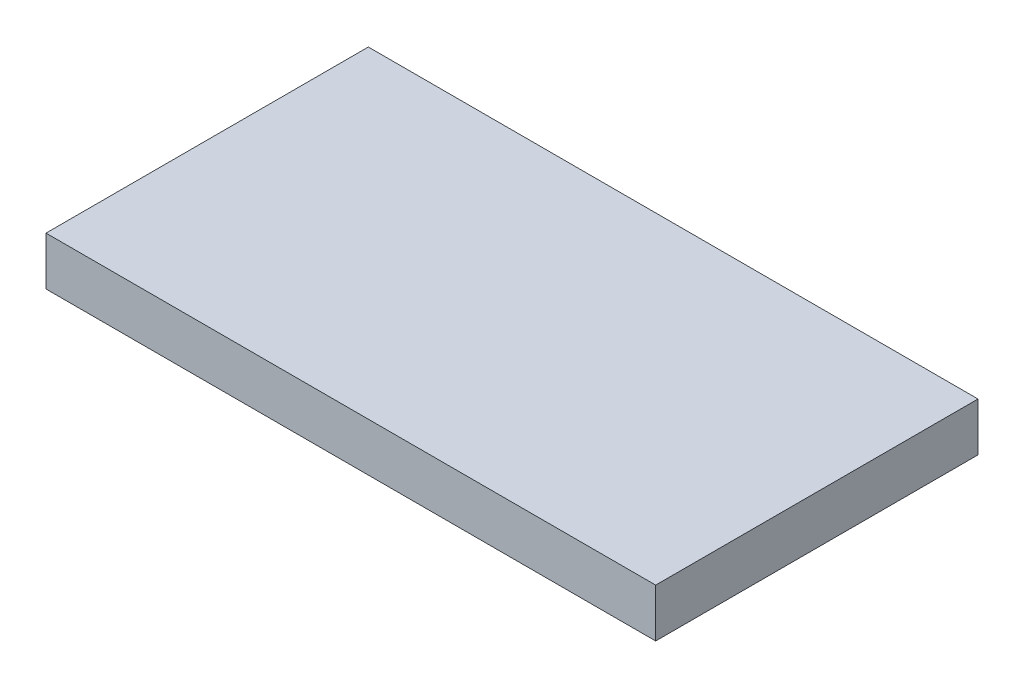
ISO-10303-21;
HEADER;
FILE_DESCRIPTION(('STEP AP214'),'2;1');
FILE_NAME('part.step','',(''),(''),'','','');
FILE_SCHEMA(('AUTOMOTIVE_DESIGN { 1 0 10303 214 1 1 1 1 }'));
ENDSEC;
DATA;
#1=APPLICATION_CONTEXT('core data for automotive mechanical design processes');
#2=APPLICATION_PROTOCOL_DEFINITION('international standard','automotive_design',2000,#1);
#3=PRODUCT_CONTEXT('',#1,'mechanical');
#4=PRODUCT('Part','Part','',(#3));
#5=PRODUCT_RELATED_PRODUCT_CATEGORY('part','',(#4));
#6=PRODUCT_DEFINITION_FORMATION('','',#4);
#7=PRODUCT_DEFINITION_CONTEXT('part definition',#1,'design');
#8=PRODUCT_DEFINITION('design','',#6,#7);
#9=PRODUCT_DEFINITION_SHAPE('','',#8);
#10=(LENGTH_UNIT() NAMED_UNIT(*) SI_UNIT(.MILLI.,.METRE.));
#11=(NAMED_UNIT(*) PLANE_ANGLE_UNIT() SI_UNIT($,.RADIAN.));
#12=(NAMED_UNIT(*) SI_UNIT($,.STERADIAN.) SOLID_ANGLE_UNIT());
#13=UNCERTAINTY_MEASURE_WITH_UNIT(LENGTH_MEASURE(1.E-05),#10,'distance_accuracy_value','');
#14=(GEOMETRIC_REPRESENTATION_CONTEXT(3) GLOBAL_UNCERTAINTY_ASSIGNED_CONTEXT((#13)) GLOBAL_UNIT_ASSIGNED_CONTEXT((#10,
#11,#12)) REPRESENTATION_CONTEXT('',''));
#15=CARTESIAN_POINT('',(0.,0.,0.));
#16=DIRECTION('',(0.,0.,1.));
#17=DIRECTION('',(1.,0.,0.));
#18=AXIS2_PLACEMENT_3D('',#15,#16,#17);
#19=CARTESIAN_POINT('',(0.,4.7625,0.));
#20=DIRECTION('',(1.,0.,0.));
#21=DIRECTION('',(0.,0.,-1.));
#22=AXIS2_PLACEMENT_3D('',#19,#20,#21);
#23=PLANE('',#22);
#24=DIRECTION('',(0.,0.,1.));
#25=VECTOR('',#24,1.);
#26=CARTESIAN_POINT('',(0.,0.,0.));
#27=LINE('',#26,#25);
#28=CARTESIAN_POINT('',(0.,0.,-31.7));
#29=VERTEX_POINT('',#28);
#30=CARTESIAN_POINT('',(0.,0.,0.));
#31=VERTEX_POINT('',#30);
#32=EDGE_CURVE('E96',#29,#31,#27,.T.);
#33=ORIENTED_EDGE('',*,*,#32,.T.);
#34=DIRECTION('',(0.,-1.,0.));
#35=VECTOR('',#34,1.);
#36=CARTESIAN_POINT('',(0.,4.7625,0.));
#37=LINE('',#36,#35);
#38=CARTESIAN_POINT('',(0.,4.7625,0.));
#39=VERTEX_POINT('',#38);
#40=EDGE_CURVE('E11',#39,#31,#37,.T.);
#41=ORIENTED_EDGE('',*,*,#40,.F.);
#42=DIRECTION('',(0.,0.,1.));
#43=VECTOR('',#42,1.);
#44=CARTESIAN_POINT('',(0.,4.7625,0.));
#45=LINE('',#44,#43);
#46=CARTESIAN_POINT('',(0.,4.7625,-31.7));
#47=VERTEX_POINT('',#46);
#48=EDGE_CURVE('E84',#47,#39,#45,.T.);
#49=ORIENTED_EDGE('',*,*,#48,.F.);
#50=DIRECTION('',(0.,-1.,0.));
#51=VECTOR('',#50,1.);
#52=CARTESIAN_POINT('',(0.,4.7625,-31.7));
#53=LINE('',#52,#51);
#54=EDGE_CURVE('E92',#47,#29,#53,.T.);
#55=ORIENTED_EDGE('',*,*,#54,.T.);
#56=EDGE_LOOP('',(#33,#41,#49,#55));
#57=FACE_BOUND('',#56,.T.);
#58=ADVANCED_FACE('F33',(#57),#23,.F.);
#59=CARTESIAN_POINT('',(0.,4.7625,0.));
#60=DIRECTION('',(0.,0.,-1.));
#61=DIRECTION('',(-1.,0.,0.));
#62=AXIS2_PLACEMENT_3D('',#59,#60,#61);
#63=PLANE('',#62);
#64=DIRECTION('',(1.,0.,0.));
#65=VECTOR('',#64,1.);
#66=CARTESIAN_POINT('',(0.,0.,0.));
#67=LINE('',#66,#65);
#68=CARTESIAN_POINT('',(59.95903926,0.,0.));
#69=VERTEX_POINT('',#68);
#70=EDGE_CURVE('E88',#31,#69,#67,.T.);
#71=ORIENTED_EDGE('',*,*,#70,.T.);
#72=DIRECTION('',(0.,-1.,0.));
#73=VECTOR('',#72,1.);
#74=CARTESIAN_POINT('',(59.95903926,4.7625,0.));
#75=LINE('',#74,#73);
#76=CARTESIAN_POINT('',(59.95903926,4.7625,0.));
#77=VERTEX_POINT('',#76);
#78=EDGE_CURVE('E41',#77,#69,#75,.T.);
#79=ORIENTED_EDGE('',*,*,#78,.F.);
#80=DIRECTION('',(1.,0.,0.));
#81=VECTOR('',#80,1.);
#82=CARTESIAN_POINT('',(0.,4.7625,0.));
#83=LINE('',#82,#81);
#84=EDGE_CURVE('E79',#39,#77,#83,.T.);
#85=ORIENTED_EDGE('',*,*,#84,.F.);
#86=ORIENTED_EDGE('',*,*,#40,.T.);
#87=EDGE_LOOP('',(#71,#79,#85,#86));
#88=FACE_BOUND('',#87,.T.);
#89=ADVANCED_FACE('F87',(#88),#63,.F.);
#90=CARTESIAN_POINT('',(59.95903926,4.7625,0.));
#91=DIRECTION('',(-1.,0.,0.));
#92=DIRECTION('',(0.,0.,1.));
#93=AXIS2_PLACEMENT_3D('',#90,#91,#92);
#94=PLANE('',#93);
#95=DIRECTION('',(0.,0.,-1.));
#96=VECTOR('',#95,1.);
#97=CARTESIAN_POINT('',(59.95903926,0.,0.));
#98=LINE('',#97,#96);
#99=CARTESIAN_POINT('',(59.95903926,0.,-31.7));
#100=VERTEX_POINT('',#99);
#101=EDGE_CURVE('E66',#69,#100,#98,.T.);
#102=ORIENTED_EDGE('',*,*,#101,.T.);
#103=DIRECTION('',(0.,-1.,0.));
#104=VECTOR('',#103,1.);
#105=CARTESIAN_POINT('',(59.95903926,4.7625,-31.7));
#106=LINE('',#105,#104);
#107=CARTESIAN_POINT('',(59.95903926,4.7625,-31.7));
#108=VERTEX_POINT('',#107);
#109=EDGE_CURVE('E89',#108,#100,#106,.T.);
#110=ORIENTED_EDGE('',*,*,#109,.F.);
#111=DIRECTION('',(0.,0.,-1.));
#112=VECTOR('',#111,1.);
#113=CARTESIAN_POINT('',(59.95903926,4.7625,0.));
#114=LINE('',#113,#112);
#115=EDGE_CURVE('E82',#77,#108,#114,.T.);
#116=ORIENTED_EDGE('',*,*,#115,.F.);
#117=ORIENTED_EDGE('',*,*,#78,.T.);
#118=EDGE_LOOP('',(#102,#110,#116,#117));
#119=FACE_BOUND('',#118,.T.);
#120=ADVANCED_FACE('F90',(#119),#94,.F.);
#121=CARTESIAN_POINT('',(0.,4.7625,-31.7));
#122=DIRECTION('',(0.,0.,1.));
#123=DIRECTION('',(1.,0.,0.));
#124=AXIS2_PLACEMENT_3D('',#121,#122,#123);
#125=PLANE('',#124);
#126=DIRECTION('',(-1.,0.,0.));
#127=VECTOR('',#126,1.);
#128=CARTESIAN_POINT('',(0.,0.,-31.7));
#129=LINE('',#128,#127);
#130=EDGE_CURVE('E72',#100,#29,#129,.T.);
#131=ORIENTED_EDGE('',*,*,#130,.T.);
#132=ORIENTED_EDGE('',*,*,#54,.F.);
#133=DIRECTION('',(-1.,0.,0.));
#134=VECTOR('',#133,1.);
#135=CARTESIAN_POINT('',(0.,4.7625,-31.7));
#136=LINE('',#135,#134);
#137=EDGE_CURVE('E49',#108,#47,#136,.T.);
#138=ORIENTED_EDGE('',*,*,#137,.F.);
#139=ORIENTED_EDGE('',*,*,#109,.T.);
#140=EDGE_LOOP('',(#131,#132,#138,#139));
#141=FACE_BOUND('',#140,.T.);
#142=ADVANCED_FACE('F103',(#141),#125,.F.);
#143=CARTESIAN_POINT('',(0.,4.7625,0.));
#144=DIRECTION('',(0.,-1.,0.));
#145=DIRECTION('',(0.,0.,-1.));
#146=AXIS2_PLACEMENT_3D('',#143,#144,#145);
#147=PLANE('',#146);
#148=ORIENTED_EDGE('',*,*,#48,.T.);
#149=ORIENTED_EDGE('',*,*,#84,.T.);
#150=ORIENTED_EDGE('',*,*,#115,.T.);
#151=ORIENTED_EDGE('',*,*,#137,.T.);
#152=EDGE_LOOP('',(#148,#149,#150,#151));
#153=FACE_BOUND('',#152,.T.);
#154=ADVANCED_FACE('F80',(#153),#147,.F.);
#155=CARTESIAN_POINT('',(0.,0.,0.));
#156=DIRECTION('',(0.,-1.,0.));
#157=DIRECTION('',(0.,0.,-1.));
#158=AXIS2_PLACEMENT_3D('',#155,#156,#157);
#159=PLANE('',#158);
#160=ORIENTED_EDGE('',*,*,#32,.F.);
#161=ORIENTED_EDGE('',*,*,#130,.F.);
#162=ORIENTED_EDGE('',*,*,#101,.F.);
#163=ORIENTED_EDGE('',*,*,#70,.F.);
#164=EDGE_LOOP('',(#160,#161,#162,#163));
#165=FACE_BOUND('',#164,.T.);
#166=ADVANCED_FACE('F106',(#165),#159,.T.);
#167=CLOSED_SHELL('',(#58,#89,#120,#142,#154,#166));
#168=MANIFOLD_SOLID_BREP('B2',#167);
#169=ADVANCED_BREP_SHAPE_REPRESENTATION('',(#18,#168),#14);
#170=SHAPE_DEFINITION_REPRESENTATION(#9,#169);
ENDSEC;
END-ISO-10303-21;
